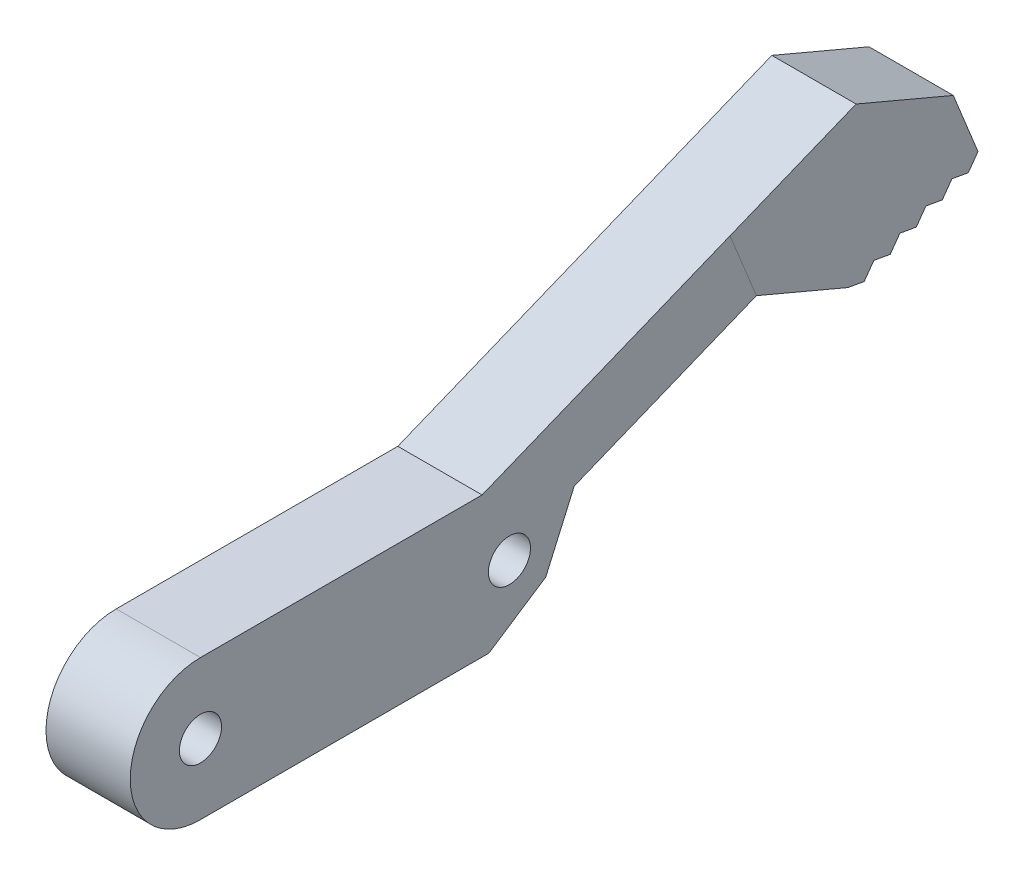
ISO-10303-21;
HEADER;
FILE_DESCRIPTION(('STEP AP214'),'2;1');
FILE_NAME('part.step','',(''),(''),'','','');
FILE_SCHEMA(('AUTOMOTIVE_DESIGN { 1 0 10303 214 1 1 1 1 }'));
ENDSEC;
DATA;
#1=APPLICATION_CONTEXT('core data for automotive mechanical design processes');
#2=APPLICATION_PROTOCOL_DEFINITION('international standard','automotive_design',2000,#1);
#3=PRODUCT_CONTEXT('',#1,'mechanical');
#4=PRODUCT('Part','Part','',(#3));
#5=PRODUCT_RELATED_PRODUCT_CATEGORY('part','',(#4));
#6=PRODUCT_DEFINITION_FORMATION('','',#4);
#7=PRODUCT_DEFINITION_CONTEXT('part definition',#1,'design');
#8=PRODUCT_DEFINITION('design','',#6,#7);
#9=PRODUCT_DEFINITION_SHAPE('','',#8);
#10=(LENGTH_UNIT() NAMED_UNIT(*) SI_UNIT(.MILLI.,.METRE.));
#11=(NAMED_UNIT(*) PLANE_ANGLE_UNIT() SI_UNIT($,.RADIAN.));
#12=(NAMED_UNIT(*) SI_UNIT($,.STERADIAN.) SOLID_ANGLE_UNIT());
#13=UNCERTAINTY_MEASURE_WITH_UNIT(LENGTH_MEASURE(1.E-05),#10,'distance_accuracy_value','');
#14=(GEOMETRIC_REPRESENTATION_CONTEXT(3) GLOBAL_UNCERTAINTY_ASSIGNED_CONTEXT((#13)) GLOBAL_UNIT_ASSIGNED_CONTEXT((#10,
#11,#12)) REPRESENTATION_CONTEXT('',''));
#15=CARTESIAN_POINT('',(0.,0.,0.));
#16=DIRECTION('',(0.,0.,1.));
#17=DIRECTION('',(1.,0.,0.));
#18=AXIS2_PLACEMENT_3D('',#15,#16,#17);
#19=CARTESIAN_POINT('',(0.,0.,0.));
#20=DIRECTION('',(1.,0.,0.));
#21=DIRECTION('',(0.,0.,-1.));
#22=AXIS2_PLACEMENT_3D('',#19,#20,#21);
#23=PLANE('',#22);
#24=CARTESIAN_POINT('',(0.,5.,-27.));
#25=DIRECTION('',(1.,0.,0.));
#26=DIRECTION('',(0.,0.,-1.));
#27=AXIS2_PLACEMENT_3D('',#24,#25,#26);
#28=CIRCLE('',#27,1.5);
#29=CARTESIAN_POINT('',(0.,5.,-28.5));
#30=VERTEX_POINT('',#29);
#31=EDGE_CURVE('E264',#30,#30,#28,.T.);
#32=ORIENTED_EDGE('',*,*,#31,.T.);
#33=EDGE_LOOP('',(#32));
#34=FACE_BOUND('',#33,.T.);
#35=CARTESIAN_POINT('',(0.,5.,-5.));
#36=DIRECTION('',(1.,0.,0.));
#37=DIRECTION('',(0.,0.,-1.));
#38=AXIS2_PLACEMENT_3D('',#35,#36,#37);
#39=CIRCLE('',#38,1.5);
#40=CARTESIAN_POINT('',(0.,5.,-6.5));
#41=VERTEX_POINT('',#40);
#42=EDGE_CURVE('E283',#41,#41,#39,.T.);
#43=ORIENTED_EDGE('',*,*,#42,.T.);
#44=EDGE_LOOP('',(#43));
#45=FACE_BOUND('',#44,.T.);
#46=DIRECTION('',(0.,0.926817277131444,0.375512629362391));
#47=VECTOR('',#46,1.);
#48=CARTESIAN_POINT('',(0.,17.2826182188115,-42.6558999798727));
#49=LINE('',#48,#47);
#50=CARTESIAN_POINT('',(0.,12.5198516022673,-44.5855996729485));
#51=VERTEX_POINT('',#50);
#52=CARTESIAN_POINT('',(0.,17.1539379879246,-42.7080365261365));
#53=VERTEX_POINT('',#52);
#54=EDGE_CURVE('E12',#51,#53,#49,.T.);
#55=ORIENTED_EDGE('',*,*,#54,.F.);
#56=DIRECTION('',(0.,0.375512629362391,-0.926817277131444));
#57=VECTOR('',#56,1.);
#58=CARTESIAN_POINT('',(0.,-4.76276661654416,-1.92969969307582));
#59=LINE('',#58,#57);
#60=CARTESIAN_POINT('',(0.,7.26267479119386,-31.6101577931083));
#61=VERTEX_POINT('',#60);
#62=EDGE_CURVE('E244',#61,#51,#59,.T.);
#63=ORIENTED_EDGE('',*,*,#62,.F.);
#64=DIRECTION('',(0.,-0.920886308223829,0.389831254937168));
#65=VECTOR('',#64,1.);
#66=CARTESIAN_POINT('',(0.,-10.2440418078816,-24.1991829086949));
#67=LINE('',#66,#65);
#68=CARTESIAN_POINT('',(0.,7.0958518163384,-31.5395379901429));
#69=VERTEX_POINT('',#68);
#70=EDGE_CURVE('E259',#61,#69,#67,.T.);
#71=ORIENTED_EDGE('',*,*,#70,.T.);
#72=DIRECTION('',(0.,-0.914844215196766,0.403806961209207));
#73=VECTOR('',#72,1.);
#74=CARTESIAN_POINT('',(0.,-10.4943006753816,-23.7753461125561));
#75=LINE('',#74,#73);
#76=CARTESIAN_POINT('',(0.,2.6649868288759,-29.5837797349184));
#77=VERTEX_POINT('',#76);
#78=EDGE_CURVE('E304',#69,#77,#75,.T.);
#79=ORIENTED_EDGE('',*,*,#78,.T.);
#80=DIRECTION('',(0.,-0.550241948439268,0.835005268353295));
#81=VECTOR('',#80,1.);
#82=CARTESIAN_POINT('',(0.,-11.7342944346662,-7.73252730012587));
#83=LINE('',#82,#81);
#84=CARTESIAN_POINT('',(0.,0.,-25.5395987187029));
#85=VERTEX_POINT('',#84);
#86=EDGE_CURVE('E292',#77,#85,#83,.T.);
#87=ORIENTED_EDGE('',*,*,#86,.T.);
#88=DIRECTION('',(0.,0.,-1.));
#89=VECTOR('',#88,1.);
#90=CARTESIAN_POINT('',(0.,0.,0.));
#91=LINE('',#90,#89);
#92=CARTESIAN_POINT('',(0.,0.,-5.));
#93=VERTEX_POINT('',#92);
#94=EDGE_CURVE('E280',#93,#85,#91,.T.);
#95=ORIENTED_EDGE('',*,*,#94,.F.);
#96=CARTESIAN_POINT('',(0.,5.,-5.));
#97=DIRECTION('',(1.,0.,0.));
#98=DIRECTION('',(0.,0.,-1.));
#99=AXIS2_PLACEMENT_3D('',#96,#97,#98);
#100=CIRCLE('',#99,5.);
#101=CARTESIAN_POINT('',(0.,10.,-5.));
#102=VERTEX_POINT('',#101);
#103=EDGE_CURVE('E278',#102,#93,#100,.T.);
#104=ORIENTED_EDGE('',*,*,#103,.F.);
#105=DIRECTION('',(0.,0.,-1.));
#106=VECTOR('',#105,1.);
#107=CARTESIAN_POINT('',(0.,10.,0.));
#108=LINE('',#107,#106);
#109=CARTESIAN_POINT('',(0.,10.,-25.0511248584953));
#110=VERTEX_POINT('',#109);
#111=EDGE_CURVE('E247',#102,#110,#108,.T.);
#112=ORIENTED_EDGE('',*,*,#111,.T.);
#113=DIRECTION('',(0.,-0.375512629362391,0.926817277131444));
#114=VECTOR('',#113,1.);
#115=CARTESIAN_POINT('',(0.,-0.128680230886938,-0.0521365462638659));
#116=LINE('',#115,#114);
#117=EDGE_CURVE('E325',#53,#110,#116,.T.);
#118=ORIENTED_EDGE('',*,*,#117,.F.);
#119=EDGE_LOOP('',(#55,#63,#71,#79,#87,#95,#104,#112,#118));
#120=FACE_BOUND('',#119,.T.);
#121=ADVANCED_FACE('F58',(#34,#45,#120),#23,.F.);
#122=CARTESIAN_POINT('',(6.,0.,0.));
#123=DIRECTION('',(1.,0.,0.));
#124=DIRECTION('',(0.,0.,-1.));
#125=AXIS2_PLACEMENT_3D('',#122,#123,#124);
#126=PLANE('',#125);
#127=CARTESIAN_POINT('',(6.,5.,-5.));
#128=DIRECTION('',(1.,0.,0.));
#129=DIRECTION('',(0.,0.,-1.));
#130=AXIS2_PLACEMENT_3D('',#127,#128,#129);
#131=CIRCLE('',#130,1.5);
#132=CARTESIAN_POINT('',(6.,5.,-6.5));
#133=VERTEX_POINT('',#132);
#134=EDGE_CURVE('E269',#133,#133,#131,.T.);
#135=ORIENTED_EDGE('',*,*,#134,.F.);
#136=EDGE_LOOP('',(#135));
#137=FACE_BOUND('',#136,.T.);
#138=CARTESIAN_POINT('',(6.,5.,-27.));
#139=DIRECTION('',(1.,0.,0.));
#140=DIRECTION('',(0.,0.,-1.));
#141=AXIS2_PLACEMENT_3D('',#138,#139,#140);
#142=CIRCLE('',#141,1.5);
#143=CARTESIAN_POINT('',(6.,5.,-28.5));
#144=VERTEX_POINT('',#143);
#145=EDGE_CURVE('E272',#144,#144,#142,.T.);
#146=ORIENTED_EDGE('',*,*,#145,.F.);
#147=EDGE_LOOP('',(#146));
#148=FACE_BOUND('',#147,.T.);
#149=DIRECTION('',(0.,0.375512629362391,-0.926817277131444));
#150=VECTOR('',#149,1.);
#151=CARTESIAN_POINT('',(6.,-4.76276661654416,-1.92969969307582));
#152=LINE('',#151,#150);
#153=CARTESIAN_POINT('',(6.,7.26267479119386,-31.6101577931083));
#154=VERTEX_POINT('',#153);
#155=CARTESIAN_POINT('',(6.,12.5198516022673,-44.5855996729485));
#156=VERTEX_POINT('',#155);
#157=EDGE_CURVE('E236',#154,#156,#152,.T.);
#158=ORIENTED_EDGE('',*,*,#157,.T.);
#159=DIRECTION('',(0.,0.926817277131444,0.375512629362391));
#160=VECTOR('',#159,1.);
#161=CARTESIAN_POINT('',(6.,17.2826182188115,-42.6558999798727));
#162=LINE('',#161,#160);
#163=CARTESIAN_POINT('',(6.,17.1539379879246,-42.7080365261365));
#164=VERTEX_POINT('',#163);
#165=EDGE_CURVE('E67',#156,#164,#162,.T.);
#166=ORIENTED_EDGE('',*,*,#165,.T.);
#167=DIRECTION('',(0.,-0.375512629362391,0.926817277131444));
#168=VECTOR('',#167,1.);
#169=CARTESIAN_POINT('',(6.,-0.128680230886938,-0.0521365462638659));
#170=LINE('',#169,#168);
#171=CARTESIAN_POINT('',(6.,10.,-25.0511248584953));
#172=VERTEX_POINT('',#171);
#173=EDGE_CURVE('E230',#164,#172,#170,.T.);
#174=ORIENTED_EDGE('',*,*,#173,.T.);
#175=DIRECTION('',(0.,0.,-1.));
#176=VECTOR('',#175,1.);
#177=CARTESIAN_POINT('',(6.,10.,0.));
#178=LINE('',#177,#176);
#179=CARTESIAN_POINT('',(6.,10.,-5.));
#180=VERTEX_POINT('',#179);
#181=EDGE_CURVE('E260',#180,#172,#178,.T.);
#182=ORIENTED_EDGE('',*,*,#181,.F.);
#183=CARTESIAN_POINT('',(6.,5.,-5.));
#184=DIRECTION('',(1.,0.,0.));
#185=DIRECTION('',(0.,0.,-1.));
#186=AXIS2_PLACEMENT_3D('',#183,#184,#185);
#187=CIRCLE('',#186,5.);
#188=CARTESIAN_POINT('',(6.,0.,-5.));
#189=VERTEX_POINT('',#188);
#190=EDGE_CURVE('E263',#180,#189,#187,.T.);
#191=ORIENTED_EDGE('',*,*,#190,.T.);
#192=DIRECTION('',(0.,0.,-1.));
#193=VECTOR('',#192,1.);
#194=CARTESIAN_POINT('',(6.,0.,0.));
#195=LINE('',#194,#193);
#196=CARTESIAN_POINT('',(6.,0.,-25.5395987187029));
#197=VERTEX_POINT('',#196);
#198=EDGE_CURVE('E266',#189,#197,#195,.T.);
#199=ORIENTED_EDGE('',*,*,#198,.T.);
#200=DIRECTION('',(0.,-0.550241948439268,0.835005268353295));
#201=VECTOR('',#200,1.);
#202=CARTESIAN_POINT('',(6.,-11.7342944346662,-7.73252730012587));
#203=LINE('',#202,#201);
#204=CARTESIAN_POINT('',(6.,2.6649868288759,-29.5837797349184));
#205=VERTEX_POINT('',#204);
#206=EDGE_CURVE('E368',#205,#197,#203,.T.);
#207=ORIENTED_EDGE('',*,*,#206,.F.);
#208=DIRECTION('',(0.,-0.914844215196766,0.403806961209207));
#209=VECTOR('',#208,1.);
#210=CARTESIAN_POINT('',(6.,-10.4943006753816,-23.7753461125561));
#211=LINE('',#210,#209);
#212=CARTESIAN_POINT('',(6.,7.0958518163384,-31.5395379901429));
#213=VERTEX_POINT('',#212);
#214=EDGE_CURVE('E365',#213,#205,#211,.T.);
#215=ORIENTED_EDGE('',*,*,#214,.F.);
#216=DIRECTION('',(0.,-0.920886308223829,0.389831254937168));
#217=VECTOR('',#216,1.);
#218=CARTESIAN_POINT('',(6.,-10.2440418078816,-24.1991829086949));
#219=LINE('',#218,#217);
#220=EDGE_CURVE('E241',#154,#213,#219,.T.);
#221=ORIENTED_EDGE('',*,*,#220,.F.);
#222=EDGE_LOOP('',(#158,#166,#174,#182,#191,#199,#207,#215,#221));
#223=FACE_BOUND('',#222,.T.);
#224=ADVANCED_FACE('F367',(#137,#148,#223),#126,.T.);
#225=ORIENTED_EDGE('',*,*,#165,.F.);
#226=DIRECTION('',(0.,-0.389831254937164,-0.920886308223831));
#227=VECTOR('',#226,1.);
#228=CARTESIAN_POINT('',(6.,26.6230259445322,-11.2701074187967));
#229=LINE('',#228,#227);
#230=CARTESIAN_POINT('',(6.,9.76332836342207,-51.0972492054176));
#231=VERTEX_POINT('',#230);
#232=EDGE_CURVE('E231',#156,#231,#229,.T.);
#233=ORIENTED_EDGE('',*,*,#232,.T.);
#234=DIRECTION('',(0.,-0.176310458660284,-0.984334608843456));
#235=VECTOR('',#234,1.);
#236=CARTESIAN_POINT('',(6.,18.3276818691169,-3.28278815708864));
#237=LINE('',#236,#235);
#238=CARTESIAN_POINT('',(6.,9.55494610819164,-52.2606394390473));
#239=VERTEX_POINT('',#238);
#240=EDGE_CURVE('E383',#231,#239,#237,.T.);
#241=ORIENTED_EDGE('',*,*,#240,.T.);
#242=DIRECTION('',(0.,0.811746559900306,-0.584009865062243));
#243=VECTOR('',#242,1.);
#244=CARTESIAN_POINT('',(6.,-21.5162149640903,-29.9065384406037));
#245=LINE('',#244,#243);
#246=CARTESIAN_POINT('',(6.,10.5143536221468,-52.9508837596805));
#247=VERTEX_POINT('',#246);
#248=EDGE_CURVE('E385',#239,#247,#245,.T.);
#249=ORIENTED_EDGE('',*,*,#248,.T.);
#250=DIRECTION('',(0.,-0.176310458660286,-0.984334608843456));
#251=VECTOR('',#250,1.);
#252=CARTESIAN_POINT('',(6.,19.3770566950698,-3.47074838444234));
#253=LINE('',#252,#251);
#254=CARTESIAN_POINT('',(6.,10.3059713669164,-54.1142739933102));
#255=VERTEX_POINT('',#254);
#256=EDGE_CURVE('E401',#247,#255,#253,.T.);
#257=ORIENTED_EDGE('',*,*,#256,.T.);
#258=DIRECTION('',(0.,0.811746559900306,-0.584009865062243));
#259=VECTOR('',#258,1.);
#260=CARTESIAN_POINT('',(6.,-22.1388134636234,-30.7719214083061));
#261=LINE('',#260,#259);
#262=CARTESIAN_POINT('',(6.,11.2653788808716,-54.8045183139434));
#263=VERTEX_POINT('',#262);
#264=EDGE_CURVE('E411',#255,#263,#261,.T.);
#265=ORIENTED_EDGE('',*,*,#264,.T.);
#266=DIRECTION('',(0.,-0.176310458660287,-0.984334608843456));
#267=VECTOR('',#266,1.);
#268=CARTESIAN_POINT('',(6.,20.4264315210226,-3.65870861179605));
#269=LINE('',#268,#267);
#270=CARTESIAN_POINT('',(6.,11.0569966256412,-55.9679085475731));
#271=VERTEX_POINT('',#270);
#272=EDGE_CURVE('E416',#263,#271,#269,.T.);
#273=ORIENTED_EDGE('',*,*,#272,.T.);
#274=DIRECTION('',(0.,0.811746559900306,-0.584009865062243));
#275=VECTOR('',#274,1.);
#276=CARTESIAN_POINT('',(6.,-22.7614119631564,-31.6373043760086));
#277=LINE('',#276,#275);
#278=CARTESIAN_POINT('',(6.,12.0164041395964,-56.6581528682063));
#279=VERTEX_POINT('',#278);
#280=EDGE_CURVE('E427',#271,#279,#277,.T.);
#281=ORIENTED_EDGE('',*,*,#280,.T.);
#282=DIRECTION('',(0.,-0.176310458660287,-0.984334608843456));
#283=VECTOR('',#282,1.);
#284=CARTESIAN_POINT('',(6.,21.4758063469754,-3.84666883914971));
#285=LINE('',#284,#283);
#286=CARTESIAN_POINT('',(6.,11.808021884366,-57.821543101836));
#287=VERTEX_POINT('',#286);
#288=EDGE_CURVE('E432',#279,#287,#285,.T.);
#289=ORIENTED_EDGE('',*,*,#288,.T.);
#290=DIRECTION('',(0.,0.811746559900303,-0.584009865062247));
#291=VECTOR('',#290,1.);
#292=CARTESIAN_POINT('',(6.,-23.3840104626895,-32.5026873437108));
#293=LINE('',#292,#291);
#294=CARTESIAN_POINT('',(6.,12.7674293983212,-58.5117874224691));
#295=VERTEX_POINT('',#294);
#296=EDGE_CURVE('E443',#287,#295,#293,.T.);
#297=ORIENTED_EDGE('',*,*,#296,.T.);
#298=DIRECTION('',(0.,-0.176310458660287,-0.984334608843456));
#299=VECTOR('',#298,1.);
#300=CARTESIAN_POINT('',(6.,22.5251811729283,-4.03462906650338));
#301=LINE('',#300,#299);
#302=CARTESIAN_POINT('',(6.,12.5590471430907,-59.6751776560989));
#303=VERTEX_POINT('',#302);
#304=EDGE_CURVE('E224',#295,#303,#301,.T.);
#305=ORIENTED_EDGE('',*,*,#304,.T.);
#306=DIRECTION('',(0.,0.811746559900308,-0.58400986506224));
#307=VECTOR('',#306,1.);
#308=CARTESIAN_POINT('',(6.,-24.0066089622226,-33.3680703114137));
#309=LINE('',#308,#307);
#310=CARTESIAN_POINT('',(6.,13.518454657046,-60.365421976732));
#311=VERTEX_POINT('',#310);
#312=EDGE_CURVE('E208',#303,#311,#309,.T.);
#313=ORIENTED_EDGE('',*,*,#312,.T.);
#314=DIRECTION('',(0.,0.926817277131444,0.37551262936239));
#315=VECTOR('',#314,1.);
#316=CARTESIAN_POINT('',(6.,22.9153076592473,-56.5581591368443));
#317=LINE('',#316,#315);
#318=CARTESIAN_POINT('',(6.,17.8605936004067,-58.6061453081692));
#319=VERTEX_POINT('',#318);
#320=EDGE_CURVE('E220',#311,#319,#317,.T.);
#321=ORIENTED_EDGE('',*,*,#320,.T.);
#322=DIRECTION('',(0.,-0.389831254937164,-0.920886308223831));
#323=VECTOR('',#322,1.);
#324=CARTESIAN_POINT('',(6.,36.1853832829632,-15.318061795041));
#325=LINE('',#324,#323);
#326=CARTESIAN_POINT('',(6.,20.7907778032993,-51.6842618551546));
#327=VERTEX_POINT('',#326);
#328=EDGE_CURVE('E340',#327,#319,#325,.T.);
#329=ORIENTED_EDGE('',*,*,#328,.F.);
#330=EDGE_CURVE('E233',#327,#164,#170,.T.);
#331=ORIENTED_EDGE('',*,*,#330,.T.);
#332=EDGE_LOOP('',(#225,#233,#241,#249,#257,#265,#273,#281,#289,#297,#305,#313,#321,#329,#331));
#333=FACE_BOUND('',#332,.T.);
#334=ADVANCED_FACE('F218',(#333),#126,.T.);
#335=DIRECTION('',(0.,-0.389831254937164,-0.920886308223831));
#336=VECTOR('',#335,1.);
#337=CARTESIAN_POINT('',(0.,26.6230259445322,-11.2701074187967));
#338=LINE('',#337,#336);
#339=CARTESIAN_POINT('',(0.,9.76332836342207,-51.0972492054176));
#340=VERTEX_POINT('',#339);
#341=EDGE_CURVE('E329',#51,#340,#338,.T.);
#342=ORIENTED_EDGE('',*,*,#341,.F.);
#343=ORIENTED_EDGE('',*,*,#54,.T.);
#344=CARTESIAN_POINT('',(0.,20.7907778032993,-51.6842618551546));
#345=VERTEX_POINT('',#344);
#346=EDGE_CURVE('E326',#345,#53,#116,.T.);
#347=ORIENTED_EDGE('',*,*,#346,.F.);
#348=DIRECTION('',(0.,-0.389831254937164,-0.920886308223831));
#349=VECTOR('',#348,1.);
#350=CARTESIAN_POINT('',(0.,36.1853832829632,-15.318061795041));
#351=LINE('',#350,#349);
#352=CARTESIAN_POINT('',(0.,17.8605936004068,-58.6061453081692));
#353=VERTEX_POINT('',#352);
#354=EDGE_CURVE('E337',#345,#353,#351,.T.);
#355=ORIENTED_EDGE('',*,*,#354,.T.);
#356=DIRECTION('',(0.,0.926817277131444,0.37551262936239));
#357=VECTOR('',#356,1.);
#358=CARTESIAN_POINT('',(0.,22.9153076592473,-56.5581591368443));
#359=LINE('',#358,#357);
#360=CARTESIAN_POINT('',(0.,13.518454657046,-60.365421976732));
#361=VERTEX_POINT('',#360);
#362=EDGE_CURVE('E327',#361,#353,#359,.T.);
#363=ORIENTED_EDGE('',*,*,#362,.F.);
#364=DIRECTION('',(0.,0.811746559900308,-0.58400986506224));
#365=VECTOR('',#364,1.);
#366=CARTESIAN_POINT('',(0.,-24.0066089622226,-33.3680703114137));
#367=LINE('',#366,#365);
#368=CARTESIAN_POINT('',(0.,12.5590471430907,-59.6751776560989));
#369=VERTEX_POINT('',#368);
#370=EDGE_CURVE('E211',#369,#361,#367,.T.);
#371=ORIENTED_EDGE('',*,*,#370,.F.);
#372=DIRECTION('',(0.,-0.176310458660287,-0.984334608843456));
#373=VECTOR('',#372,1.);
#374=CARTESIAN_POINT('',(0.,22.5251811729283,-4.03462906650338));
#375=LINE('',#374,#373);
#376=CARTESIAN_POINT('',(0.,12.7674293983212,-58.5117874224691));
#377=VERTEX_POINT('',#376);
#378=EDGE_CURVE('E435',#377,#369,#375,.T.);
#379=ORIENTED_EDGE('',*,*,#378,.F.);
#380=DIRECTION('',(0.,0.811746559900303,-0.584009865062247));
#381=VECTOR('',#380,1.);
#382=CARTESIAN_POINT('',(0.,-23.3840104626895,-32.5026873437108));
#383=LINE('',#382,#381);
#384=CARTESIAN_POINT('',(0.,11.808021884366,-57.821543101836));
#385=VERTEX_POINT('',#384);
#386=EDGE_CURVE('E438',#385,#377,#383,.T.);
#387=ORIENTED_EDGE('',*,*,#386,.F.);
#388=DIRECTION('',(0.,-0.176310458660287,-0.984334608843456));
#389=VECTOR('',#388,1.);
#390=CARTESIAN_POINT('',(0.,21.4758063469754,-3.84666883914971));
#391=LINE('',#390,#389);
#392=CARTESIAN_POINT('',(0.,12.0164041395964,-56.6581528682063));
#393=VERTEX_POINT('',#392);
#394=EDGE_CURVE('E419',#393,#385,#391,.T.);
#395=ORIENTED_EDGE('',*,*,#394,.F.);
#396=DIRECTION('',(0.,0.811746559900306,-0.584009865062243));
#397=VECTOR('',#396,1.);
#398=CARTESIAN_POINT('',(0.,-22.7614119631564,-31.6373043760086));
#399=LINE('',#398,#397);
#400=CARTESIAN_POINT('',(0.,11.0569966256412,-55.9679085475731));
#401=VERTEX_POINT('',#400);
#402=EDGE_CURVE('E422',#401,#393,#399,.T.);
#403=ORIENTED_EDGE('',*,*,#402,.F.);
#404=DIRECTION('',(0.,-0.176310458660287,-0.984334608843456));
#405=VECTOR('',#404,1.);
#406=CARTESIAN_POINT('',(0.,20.4264315210226,-3.65870861179605));
#407=LINE('',#406,#405);
#408=CARTESIAN_POINT('',(0.,11.2653788808716,-54.8045183139434));
#409=VERTEX_POINT('',#408);
#410=EDGE_CURVE('E403',#409,#401,#407,.T.);
#411=ORIENTED_EDGE('',*,*,#410,.F.);
#412=DIRECTION('',(0.,0.811746559900306,-0.584009865062243));
#413=VECTOR('',#412,1.);
#414=CARTESIAN_POINT('',(0.,-22.1388134636234,-30.7719214083062));
#415=LINE('',#414,#413);
#416=CARTESIAN_POINT('',(0.,10.3059713669164,-54.1142739933102));
#417=VERTEX_POINT('',#416);
#418=EDGE_CURVE('E406',#417,#409,#415,.T.);
#419=ORIENTED_EDGE('',*,*,#418,.F.);
#420=DIRECTION('',(0.,-0.176310458660286,-0.984334608843456));
#421=VECTOR('',#420,1.);
#422=CARTESIAN_POINT('',(0.,19.3770566950698,-3.47074838444234));
#423=LINE('',#422,#421);
#424=CARTESIAN_POINT('',(0.,10.5143536221468,-52.9508837596805));
#425=VERTEX_POINT('',#424);
#426=EDGE_CURVE('E388',#425,#417,#423,.T.);
#427=ORIENTED_EDGE('',*,*,#426,.F.);
#428=DIRECTION('',(0.,0.811746559900306,-0.584009865062243));
#429=VECTOR('',#428,1.);
#430=CARTESIAN_POINT('',(0.,-21.5162149640903,-29.9065384406037));
#431=LINE('',#430,#429);
#432=CARTESIAN_POINT('',(0.,9.55494610819164,-52.2606394390473));
#433=VERTEX_POINT('',#432);
#434=EDGE_CURVE('E391',#433,#425,#431,.T.);
#435=ORIENTED_EDGE('',*,*,#434,.F.);
#436=DIRECTION('',(0.,-0.176310458660284,-0.984334608843456));
#437=VECTOR('',#436,1.);
#438=CARTESIAN_POINT('',(0.,18.3276818691169,-3.28278815708864));
#439=LINE('',#438,#437);
#440=EDGE_CURVE('E353',#340,#433,#439,.T.);
#441=ORIENTED_EDGE('',*,*,#440,.F.);
#442=EDGE_LOOP('',(#342,#343,#347,#355,#363,#371,#379,#387,#395,#403,#411,#419,#427,#435,#441));
#443=FACE_BOUND('',#442,.T.);
#444=ADVANCED_FACE('F350',(#443),#23,.F.);
#445=CARTESIAN_POINT('',(0.,22.9153076592473,-56.5581591368443));
#446=DIRECTION('',(0.,0.37551262936239,-0.926817277131444));
#447=DIRECTION('',(0.,0.926817277131444,0.37551262936239));
#448=AXIS2_PLACEMENT_3D('',#445,#446,#447);
#449=PLANE('',#448);
#450=ORIENTED_EDGE('',*,*,#320,.F.);
#451=DIRECTION('',(1.,0.,0.));
#452=VECTOR('',#451,1.);
#453=CARTESIAN_POINT('',(-4.,13.518454657046,-60.365421976732));
#454=LINE('',#453,#452);
#455=EDGE_CURVE('E205',#361,#311,#454,.T.);
#456=ORIENTED_EDGE('',*,*,#455,.F.);
#457=ORIENTED_EDGE('',*,*,#362,.T.);
#458=DIRECTION('',(1.,0.,0.));
#459=VECTOR('',#458,1.);
#460=CARTESIAN_POINT('',(0.,17.8605936004068,-58.6061453081692));
#461=LINE('',#460,#459);
#462=EDGE_CURVE('E229',#353,#319,#461,.T.);
#463=ORIENTED_EDGE('',*,*,#462,.T.);
#464=EDGE_LOOP('',(#450,#456,#457,#463));
#465=FACE_BOUND('',#464,.T.);
#466=ADVANCED_FACE('F227',(#465),#449,.T.);
#467=CARTESIAN_POINT('',(6.,10.,0.));
#468=DIRECTION('',(0.,1.,0.));
#469=DIRECTION('',(0.,0.,1.));
#470=AXIS2_PLACEMENT_3D('',#467,#468,#469);
#471=PLANE('',#470);
#472=DIRECTION('',(1.,0.,0.));
#473=VECTOR('',#472,1.);
#474=CARTESIAN_POINT('',(0.,10.,-25.0511248584953));
#475=LINE('',#474,#473);
#476=EDGE_CURVE('E250',#110,#172,#475,.T.);
#477=ORIENTED_EDGE('',*,*,#476,.F.);
#478=ORIENTED_EDGE('',*,*,#111,.F.);
#479=DIRECTION('',(-1.,0.,0.));
#480=VECTOR('',#479,1.);
#481=CARTESIAN_POINT('',(6.,10.,-5.));
#482=LINE('',#481,#480);
#483=EDGE_CURVE('E290',#180,#102,#482,.T.);
#484=ORIENTED_EDGE('',*,*,#483,.F.);
#485=ORIENTED_EDGE('',*,*,#181,.T.);
#486=EDGE_LOOP('',(#477,#478,#484,#485));
#487=FACE_BOUND('',#486,.T.);
#488=ADVANCED_FACE('F60',(#487),#471,.T.);
#489=CARTESIAN_POINT('',(6.,5.,-5.));
#490=DIRECTION('',(-1.,0.,0.));
#491=DIRECTION('',(0.,0.,1.));
#492=AXIS2_PLACEMENT_3D('',#489,#490,#491);
#493=CYLINDRICAL_SURFACE('',#492,5.);
#494=ORIENTED_EDGE('',*,*,#103,.T.);
#495=DIRECTION('',(-1.,0.,0.));
#496=VECTOR('',#495,1.);
#497=CARTESIAN_POINT('',(6.,0.,-5.));
#498=LINE('',#497,#496);
#499=EDGE_CURVE('E275',#189,#93,#498,.T.);
#500=ORIENTED_EDGE('',*,*,#499,.F.);
#501=ORIENTED_EDGE('',*,*,#190,.F.);
#502=ORIENTED_EDGE('',*,*,#483,.T.);
#503=EDGE_LOOP('',(#494,#500,#501,#502));
#504=FACE_BOUND('',#503,.T.);
#505=ADVANCED_FACE('F315',(#504),#493,.T.);
#506=CARTESIAN_POINT('',(6.,0.,0.));
#507=DIRECTION('',(0.,1.,0.));
#508=DIRECTION('',(0.,0.,1.));
#509=AXIS2_PLACEMENT_3D('',#506,#507,#508);
#510=PLANE('',#509);
#511=ORIENTED_EDGE('',*,*,#94,.T.);
#512=DIRECTION('',(1.,0.,0.));
#513=VECTOR('',#512,1.);
#514=CARTESIAN_POINT('',(-4.,0.,-25.5395987187029));
#515=LINE('',#514,#513);
#516=EDGE_CURVE('E311',#85,#197,#515,.T.);
#517=ORIENTED_EDGE('',*,*,#516,.T.);
#518=ORIENTED_EDGE('',*,*,#198,.F.);
#519=ORIENTED_EDGE('',*,*,#499,.T.);
#520=EDGE_LOOP('',(#511,#517,#518,#519));
#521=FACE_BOUND('',#520,.T.);
#522=ADVANCED_FACE('F309',(#521),#510,.F.);
#523=CARTESIAN_POINT('',(6.,5.,-5.));
#524=DIRECTION('',(-1.,0.,0.));
#525=DIRECTION('',(0.,0.,1.));
#526=AXIS2_PLACEMENT_3D('',#523,#524,#525);
#527=CYLINDRICAL_SURFACE('',#526,1.5);
#528=ORIENTED_EDGE('',*,*,#134,.T.);
#529=EDGE_LOOP('',(#528));
#530=FACE_BOUND('',#529,.T.);
#531=ORIENTED_EDGE('',*,*,#42,.F.);
#532=EDGE_LOOP('',(#531));
#533=FACE_BOUND('',#532,.T.);
#534=ADVANCED_FACE('F652',(#530,#533),#527,.F.);
#535=CARTESIAN_POINT('',(6.,5.,-27.));
#536=DIRECTION('',(-1.,0.,0.));
#537=DIRECTION('',(0.,0.,1.));
#538=AXIS2_PLACEMENT_3D('',#535,#536,#537);
#539=CYLINDRICAL_SURFACE('',#538,1.5);
#540=ORIENTED_EDGE('',*,*,#145,.T.);
#541=EDGE_LOOP('',(#540));
#542=FACE_BOUND('',#541,.T.);
#543=ORIENTED_EDGE('',*,*,#31,.F.);
#544=EDGE_LOOP('',(#543));
#545=FACE_BOUND('',#544,.T.);
#546=ADVANCED_FACE('F492',(#542,#545),#539,.F.);
#547=CARTESIAN_POINT('',(0.,-4.76276661654416,-1.92969969307582));
#548=DIRECTION('',(0.,-0.926817277131444,-0.375512629362391));
#549=DIRECTION('',(0.,0.375512629362391,-0.926817277131444));
#550=AXIS2_PLACEMENT_3D('',#547,#548,#549);
#551=PLANE('',#550);
#552=ORIENTED_EDGE('',*,*,#157,.F.);
#553=DIRECTION('',(1.,0.,0.));
#554=VECTOR('',#553,1.);
#555=CARTESIAN_POINT('',(0.,7.26267479119386,-31.6101577931083));
#556=LINE('',#555,#554);
#557=EDGE_CURVE('E245',#61,#154,#556,.T.);
#558=ORIENTED_EDGE('',*,*,#557,.F.);
#559=ORIENTED_EDGE('',*,*,#62,.T.);
#560=DIRECTION('',(1.,0.,0.));
#561=VECTOR('',#560,1.);
#562=CARTESIAN_POINT('',(0.,12.5198516022673,-44.5855996729485));
#563=LINE('',#562,#561);
#564=EDGE_CURVE('E256',#51,#156,#563,.T.);
#565=ORIENTED_EDGE('',*,*,#564,.T.);
#566=EDGE_LOOP('',(#552,#558,#559,#565));
#567=FACE_BOUND('',#566,.T.);
#568=ADVANCED_FACE('F356',(#567),#551,.T.);
#569=CARTESIAN_POINT('',(0.,-10.2440418078816,-24.1991829086949));
#570=DIRECTION('',(0.,0.389831254937168,0.920886308223829));
#571=DIRECTION('',(0.,-0.920886308223829,0.389831254937168));
#572=AXIS2_PLACEMENT_3D('',#569,#570,#571);
#573=PLANE('',#572);
#574=ORIENTED_EDGE('',*,*,#220,.T.);
#575=DIRECTION('',(1.,0.,0.));
#576=VECTOR('',#575,1.);
#577=CARTESIAN_POINT('',(0.,7.0958518163384,-31.5395379901429));
#578=LINE('',#577,#576);
#579=EDGE_CURVE('E248',#69,#213,#578,.T.);
#580=ORIENTED_EDGE('',*,*,#579,.F.);
#581=ORIENTED_EDGE('',*,*,#70,.F.);
#582=ORIENTED_EDGE('',*,*,#557,.T.);
#583=EDGE_LOOP('',(#574,#580,#581,#582));
#584=FACE_BOUND('',#583,.T.);
#585=ADVANCED_FACE('F360',(#584),#573,.F.);
#586=CARTESIAN_POINT('',(0.,-0.128680230886938,-0.0521365462638659));
#587=DIRECTION('',(0.,0.926817277131444,0.375512629362391));
#588=DIRECTION('',(0.,-0.375512629362391,0.926817277131444));
#589=AXIS2_PLACEMENT_3D('',#586,#587,#588);
#590=PLANE('',#589);
#591=DIRECTION('',(1.,0.,0.));
#592=VECTOR('',#591,1.);
#593=CARTESIAN_POINT('',(0.,20.7907778032993,-51.6842618551546));
#594=LINE('',#593,#592);
#595=EDGE_CURVE('E335',#345,#327,#594,.T.);
#596=ORIENTED_EDGE('',*,*,#595,.F.);
#597=ORIENTED_EDGE('',*,*,#346,.T.);
#598=ORIENTED_EDGE('',*,*,#117,.T.);
#599=ORIENTED_EDGE('',*,*,#476,.T.);
#600=ORIENTED_EDGE('',*,*,#173,.F.);
#601=ORIENTED_EDGE('',*,*,#330,.F.);
#602=EDGE_LOOP('',(#596,#597,#598,#599,#600,#601));
#603=FACE_BOUND('',#602,.T.);
#604=ADVANCED_FACE('F322',(#603),#590,.T.);
#605=CARTESIAN_POINT('',(0.,26.6230259445322,-11.2701074187967));
#606=DIRECTION('',(0.,-0.920886308223831,0.389831254937164));
#607=DIRECTION('',(0.,-0.389831254937164,-0.920886308223831));
#608=AXIS2_PLACEMENT_3D('',#605,#606,#607);
#609=PLANE('',#608);
#610=ORIENTED_EDGE('',*,*,#232,.F.);
#611=ORIENTED_EDGE('',*,*,#564,.F.);
#612=ORIENTED_EDGE('',*,*,#341,.T.);
#613=DIRECTION('',(1.,0.,0.));
#614=VECTOR('',#613,1.);
#615=CARTESIAN_POINT('',(0.,9.76332836342207,-51.0972492054176));
#616=LINE('',#615,#614);
#617=EDGE_CURVE('E253',#340,#231,#616,.T.);
#618=ORIENTED_EDGE('',*,*,#617,.T.);
#619=EDGE_LOOP('',(#610,#611,#612,#618));
#620=FACE_BOUND('',#619,.T.);
#621=ADVANCED_FACE('F348',(#620),#609,.T.);
#622=CARTESIAN_POINT('',(0.,36.1853832829632,-15.318061795041));
#623=DIRECTION('',(0.,-0.920886308223831,0.389831254937164));
#624=DIRECTION('',(0.,-0.389831254937164,-0.920886308223831));
#625=AXIS2_PLACEMENT_3D('',#622,#623,#624);
#626=PLANE('',#625);
#627=ORIENTED_EDGE('',*,*,#328,.T.);
#628=ORIENTED_EDGE('',*,*,#462,.F.);
#629=ORIENTED_EDGE('',*,*,#354,.F.);
#630=ORIENTED_EDGE('',*,*,#595,.T.);
#631=EDGE_LOOP('',(#627,#628,#629,#630));
#632=FACE_BOUND('',#631,.T.);
#633=ADVANCED_FACE('F380',(#632),#626,.F.);
#634=CARTESIAN_POINT('',(-4.,-11.7342944346662,-7.73252730012587));
#635=DIRECTION('',(0.,0.835005268353295,0.550241948439268));
#636=DIRECTION('',(0.,-0.550241948439268,0.835005268353295));
#637=AXIS2_PLACEMENT_3D('',#634,#635,#636);
#638=PLANE('',#637);
#639=DIRECTION('',(1.,0.,0.));
#640=VECTOR('',#639,1.);
#641=CARTESIAN_POINT('',(-4.,2.6649868288759,-29.5837797349184));
#642=LINE('',#641,#640);
#643=EDGE_CURVE('E370',#77,#205,#642,.T.);
#644=ORIENTED_EDGE('',*,*,#643,.T.);
#645=ORIENTED_EDGE('',*,*,#206,.T.);
#646=ORIENTED_EDGE('',*,*,#516,.F.);
#647=ORIENTED_EDGE('',*,*,#86,.F.);
#648=EDGE_LOOP('',(#644,#645,#646,#647));
#649=FACE_BOUND('',#648,.T.);
#650=ADVANCED_FACE('F501',(#649),#638,.F.);
#651=CARTESIAN_POINT('',(-4.,-10.4943006753816,-23.7753461125561));
#652=DIRECTION('',(0.,0.403806961209207,0.914844215196766));
#653=DIRECTION('',(0.,-0.914844215196766,0.403806961209207));
#654=AXIS2_PLACEMENT_3D('',#651,#652,#653);
#655=PLANE('',#654);
#656=ORIENTED_EDGE('',*,*,#579,.T.);
#657=ORIENTED_EDGE('',*,*,#214,.T.);
#658=ORIENTED_EDGE('',*,*,#643,.F.);
#659=ORIENTED_EDGE('',*,*,#78,.F.);
#660=EDGE_LOOP('',(#656,#657,#658,#659));
#661=FACE_BOUND('',#660,.T.);
#662=ADVANCED_FACE('F364',(#661),#655,.F.);
#663=CARTESIAN_POINT('',(-4.,18.3276818691169,-3.28278815708864));
#664=DIRECTION('',(0.,-0.984334608843456,0.176310458660284));
#665=DIRECTION('',(0.,-0.176310458660284,-0.984334608843456));
#666=AXIS2_PLACEMENT_3D('',#663,#664,#665);
#667=PLANE('',#666);
#668=ORIENTED_EDGE('',*,*,#440,.T.);
#669=DIRECTION('',(1.,0.,0.));
#670=VECTOR('',#669,1.);
#671=CARTESIAN_POINT('',(-4.,9.55494610819164,-52.2606394390473));
#672=LINE('',#671,#670);
#673=EDGE_CURVE('E372',#433,#239,#672,.T.);
#674=ORIENTED_EDGE('',*,*,#673,.T.);
#675=ORIENTED_EDGE('',*,*,#240,.F.);
#676=ORIENTED_EDGE('',*,*,#617,.F.);
#677=EDGE_LOOP('',(#668,#674,#675,#676));
#678=FACE_BOUND('',#677,.T.);
#679=ADVANCED_FACE('F504',(#678),#667,.T.);
#680=CARTESIAN_POINT('',(-4.,19.3770566950698,-3.47074838444234));
#681=DIRECTION('',(0.,-0.984334608843456,0.176310458660286));
#682=DIRECTION('',(0.,-0.176310458660286,-0.984334608843456));
#683=AXIS2_PLACEMENT_3D('',#680,#681,#682);
#684=PLANE('',#683);
#685=ORIENTED_EDGE('',*,*,#426,.T.);
#686=DIRECTION('',(1.,0.,0.));
#687=VECTOR('',#686,1.);
#688=CARTESIAN_POINT('',(-4.,10.3059713669164,-54.1142739933102));
#689=LINE('',#688,#687);
#690=EDGE_CURVE('E395',#417,#255,#689,.T.);
#691=ORIENTED_EDGE('',*,*,#690,.T.);
#692=ORIENTED_EDGE('',*,*,#256,.F.);
#693=DIRECTION('',(1.,0.,0.));
#694=VECTOR('',#693,1.);
#695=CARTESIAN_POINT('',(-4.,10.5143536221468,-52.9508837596805));
#696=LINE('',#695,#694);
#697=EDGE_CURVE('E396',#425,#247,#696,.T.);
#698=ORIENTED_EDGE('',*,*,#697,.F.);
#699=EDGE_LOOP('',(#685,#691,#692,#698));
#700=FACE_BOUND('',#699,.T.);
#701=ADVANCED_FACE('F509',(#700),#684,.T.);
#702=CARTESIAN_POINT('',(-4.,-21.5162149640903,-29.9065384406037));
#703=DIRECTION('',(0.,-0.584009865062243,-0.811746559900306));
#704=DIRECTION('',(0.,0.811746559900306,-0.584009865062243));
#705=AXIS2_PLACEMENT_3D('',#702,#703,#704);
#706=PLANE('',#705);
#707=ORIENTED_EDGE('',*,*,#434,.T.);
#708=ORIENTED_EDGE('',*,*,#697,.T.);
#709=ORIENTED_EDGE('',*,*,#248,.F.);
#710=ORIENTED_EDGE('',*,*,#673,.F.);
#711=EDGE_LOOP('',(#707,#708,#709,#710));
#712=FACE_BOUND('',#711,.T.);
#713=ADVANCED_FACE('F512',(#712),#706,.T.);
#714=CARTESIAN_POINT('',(-4.,20.4264315210226,-3.65870861179605));
#715=DIRECTION('',(0.,-0.984334608843456,0.176310458660287));
#716=DIRECTION('',(0.,-0.176310458660287,-0.984334608843456));
#717=AXIS2_PLACEMENT_3D('',#714,#715,#716);
#718=PLANE('',#717);
#719=ORIENTED_EDGE('',*,*,#410,.T.);
#720=DIRECTION('',(1.,0.,0.));
#721=VECTOR('',#720,1.);
#722=CARTESIAN_POINT('',(-4.,11.0569966256412,-55.9679085475731));
#723=LINE('',#722,#721);
#724=EDGE_CURVE('E408',#401,#271,#723,.T.);
#725=ORIENTED_EDGE('',*,*,#724,.T.);
#726=ORIENTED_EDGE('',*,*,#272,.F.);
#727=DIRECTION('',(1.,0.,0.));
#728=VECTOR('',#727,1.);
#729=CARTESIAN_POINT('',(-4.,11.2653788808716,-54.8045183139434));
#730=LINE('',#729,#728);
#731=EDGE_CURVE('E409',#409,#263,#730,.T.);
#732=ORIENTED_EDGE('',*,*,#731,.F.);
#733=EDGE_LOOP('',(#719,#725,#726,#732));
#734=FACE_BOUND('',#733,.T.);
#735=ADVANCED_FACE('F516',(#734),#718,.T.);
#736=CARTESIAN_POINT('',(-4.,-22.1388134636234,-30.7719214083061));
#737=DIRECTION('',(0.,-0.584009865062243,-0.811746559900306));
#738=DIRECTION('',(0.,0.811746559900306,-0.584009865062243));
#739=AXIS2_PLACEMENT_3D('',#736,#737,#738);
#740=PLANE('',#739);
#741=ORIENTED_EDGE('',*,*,#418,.T.);
#742=ORIENTED_EDGE('',*,*,#731,.T.);
#743=ORIENTED_EDGE('',*,*,#264,.F.);
#744=ORIENTED_EDGE('',*,*,#690,.F.);
#745=EDGE_LOOP('',(#741,#742,#743,#744));
#746=FACE_BOUND('',#745,.T.);
#747=ADVANCED_FACE('F520',(#746),#740,.T.);
#748=CARTESIAN_POINT('',(-4.,21.4758063469754,-3.84666883914971));
#749=DIRECTION('',(0.,-0.984334608843456,0.176310458660287));
#750=DIRECTION('',(0.,-0.176310458660287,-0.984334608843456));
#751=AXIS2_PLACEMENT_3D('',#748,#749,#750);
#752=PLANE('',#751);
#753=ORIENTED_EDGE('',*,*,#394,.T.);
#754=DIRECTION('',(1.,0.,0.));
#755=VECTOR('',#754,1.);
#756=CARTESIAN_POINT('',(-4.,11.808021884366,-57.821543101836));
#757=LINE('',#756,#755);
#758=EDGE_CURVE('E424',#385,#287,#757,.T.);
#759=ORIENTED_EDGE('',*,*,#758,.T.);
#760=ORIENTED_EDGE('',*,*,#288,.F.);
#761=DIRECTION('',(1.,0.,0.));
#762=VECTOR('',#761,1.);
#763=CARTESIAN_POINT('',(-4.,12.0164041395964,-56.6581528682063));
#764=LINE('',#763,#762);
#765=EDGE_CURVE('E425',#393,#279,#764,.T.);
#766=ORIENTED_EDGE('',*,*,#765,.F.);
#767=EDGE_LOOP('',(#753,#759,#760,#766));
#768=FACE_BOUND('',#767,.T.);
#769=ADVANCED_FACE('F453',(#768),#752,.T.);
#770=CARTESIAN_POINT('',(-4.,-22.7614119631564,-31.6373043760086));
#771=DIRECTION('',(0.,-0.584009865062243,-0.811746559900306));
#772=DIRECTION('',(0.,0.811746559900306,-0.584009865062243));
#773=AXIS2_PLACEMENT_3D('',#770,#771,#772);
#774=PLANE('',#773);
#775=ORIENTED_EDGE('',*,*,#402,.T.);
#776=ORIENTED_EDGE('',*,*,#765,.T.);
#777=ORIENTED_EDGE('',*,*,#280,.F.);
#778=ORIENTED_EDGE('',*,*,#724,.F.);
#779=EDGE_LOOP('',(#775,#776,#777,#778));
#780=FACE_BOUND('',#779,.T.);
#781=ADVANCED_FACE('F462',(#780),#774,.T.);
#782=CARTESIAN_POINT('',(-4.,22.5251811729283,-4.03462906650338));
#783=DIRECTION('',(0.,-0.984334608843456,0.176310458660287));
#784=DIRECTION('',(0.,-0.176310458660287,-0.984334608843456));
#785=AXIS2_PLACEMENT_3D('',#782,#783,#784);
#786=PLANE('',#785);
#787=ORIENTED_EDGE('',*,*,#378,.T.);
#788=DIRECTION('',(1.,0.,0.));
#789=VECTOR('',#788,1.);
#790=CARTESIAN_POINT('',(-4.,12.5590471430907,-59.6751776560989));
#791=LINE('',#790,#789);
#792=EDGE_CURVE('E440',#369,#303,#791,.T.);
#793=ORIENTED_EDGE('',*,*,#792,.T.);
#794=ORIENTED_EDGE('',*,*,#304,.F.);
#795=DIRECTION('',(1.,0.,0.));
#796=VECTOR('',#795,1.);
#797=CARTESIAN_POINT('',(-4.,12.7674293983212,-58.5117874224691));
#798=LINE('',#797,#796);
#799=EDGE_CURVE('E441',#377,#295,#798,.T.);
#800=ORIENTED_EDGE('',*,*,#799,.F.);
#801=EDGE_LOOP('',(#787,#793,#794,#800));
#802=FACE_BOUND('',#801,.T.);
#803=ADVANCED_FACE('F460',(#802),#786,.T.);
#804=CARTESIAN_POINT('',(-4.,-23.3840104626895,-32.5026873437108));
#805=DIRECTION('',(0.,-0.584009865062247,-0.811746559900303));
#806=DIRECTION('',(0.,0.811746559900303,-0.584009865062247));
#807=AXIS2_PLACEMENT_3D('',#804,#805,#806);
#808=PLANE('',#807);
#809=ORIENTED_EDGE('',*,*,#386,.T.);
#810=ORIENTED_EDGE('',*,*,#799,.T.);
#811=ORIENTED_EDGE('',*,*,#296,.F.);
#812=ORIENTED_EDGE('',*,*,#758,.F.);
#813=EDGE_LOOP('',(#809,#810,#811,#812));
#814=FACE_BOUND('',#813,.T.);
#815=ADVANCED_FACE('F449',(#814),#808,.T.);
#816=CARTESIAN_POINT('',(-4.,-24.0066089622226,-33.3680703114137));
#817=DIRECTION('',(0.,-0.58400986506224,-0.811746559900308));
#818=DIRECTION('',(0.,0.811746559900308,-0.58400986506224));
#819=AXIS2_PLACEMENT_3D('',#816,#817,#818);
#820=PLANE('',#819);
#821=ORIENTED_EDGE('',*,*,#370,.T.);
#822=ORIENTED_EDGE('',*,*,#455,.T.);
#823=ORIENTED_EDGE('',*,*,#312,.F.);
#824=ORIENTED_EDGE('',*,*,#792,.F.);
#825=EDGE_LOOP('',(#821,#822,#823,#824));
#826=FACE_BOUND('',#825,.T.);
#827=ADVANCED_FACE('F207',(#826),#820,.T.);
#828=CLOSED_SHELL('',(#121,#224,#334,#444,#466,#488,#505,#522,#534,#546,#568,#585,#604,#621,
#633,#650,#662,#679,#701,#713,#735,#747,#769,#781,#803,#815,#827));
#829=MANIFOLD_SOLID_BREP('B2',#828);
#830=ADVANCED_BREP_SHAPE_REPRESENTATION('',(#18,#829),#14);
#831=SHAPE_DEFINITION_REPRESENTATION(#9,#830);
ENDSEC;
END-ISO-10303-21;
